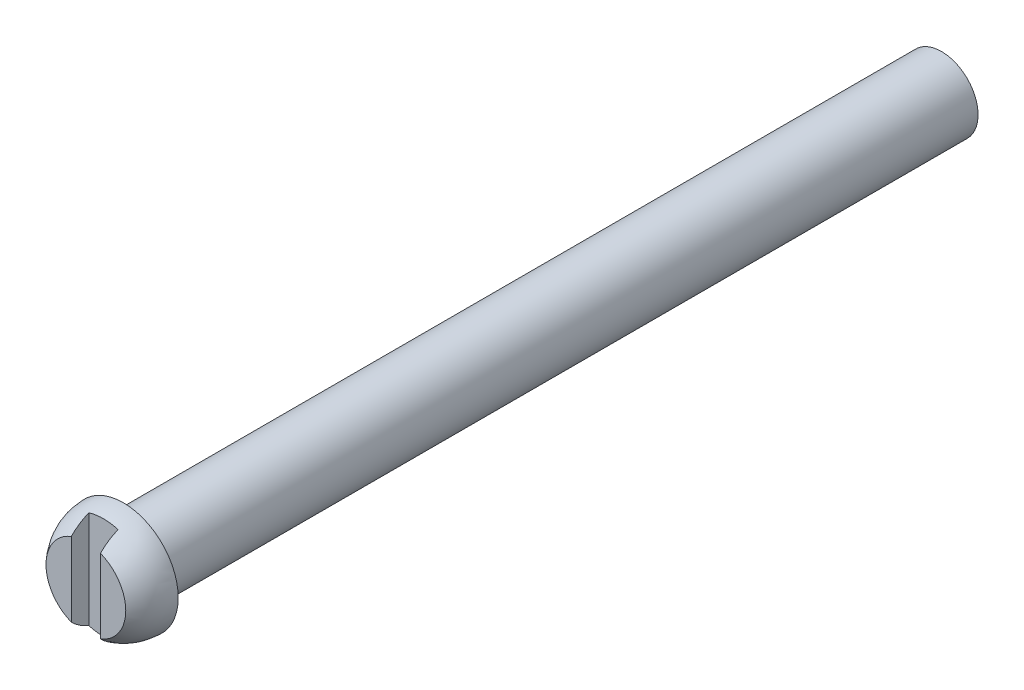
ISO-10303-21;
HEADER;
FILE_DESCRIPTION(('STEP AP214'),'2;1');
FILE_NAME('part.step','',(''),(''),'','','');
FILE_SCHEMA(('AUTOMOTIVE_DESIGN { 1 0 10303 214 1 1 1 1 }'));
ENDSEC;
DATA;
#1=APPLICATION_CONTEXT('core data for automotive mechanical design processes');
#2=APPLICATION_PROTOCOL_DEFINITION('international standard','automotive_design',2000,#1);
#3=PRODUCT_CONTEXT('',#1,'mechanical');
#4=PRODUCT('Part','Part','',(#3));
#5=PRODUCT_RELATED_PRODUCT_CATEGORY('part','',(#4));
#6=PRODUCT_DEFINITION_FORMATION('','',#4);
#7=PRODUCT_DEFINITION_CONTEXT('part definition',#1,'design');
#8=PRODUCT_DEFINITION('design','',#6,#7);
#9=PRODUCT_DEFINITION_SHAPE('','',#8);
#10=(LENGTH_UNIT() NAMED_UNIT(*) SI_UNIT(.MILLI.,.METRE.));
#11=(NAMED_UNIT(*) PLANE_ANGLE_UNIT() SI_UNIT($,.RADIAN.));
#12=(NAMED_UNIT(*) SI_UNIT($,.STERADIAN.) SOLID_ANGLE_UNIT());
#13=UNCERTAINTY_MEASURE_WITH_UNIT(LENGTH_MEASURE(1.E-05),#10,'distance_accuracy_value','');
#14=(GEOMETRIC_REPRESENTATION_CONTEXT(3) GLOBAL_UNCERTAINTY_ASSIGNED_CONTEXT((#13)) GLOBAL_UNIT_ASSIGNED_CONTEXT((#10,
#11,#12)) REPRESENTATION_CONTEXT('',''));
#15=CARTESIAN_POINT('',(0.,0.,0.));
#16=DIRECTION('',(0.,0.,1.));
#17=DIRECTION('',(1.,0.,0.));
#18=AXIS2_PLACEMENT_3D('',#15,#16,#17);
#19=CARTESIAN_POINT('',(10.922,4.84644785326985,23.5854825437784));
#20=DIRECTION('',(0.,0.,1.));
#21=DIRECTION('',(1.,0.,0.));
#22=AXIS2_PLACEMENT_3D('',#19,#20,#21);
#23=PLANE('',#22);
#24=DIRECTION('',(0.,1.,0.));
#25=VECTOR('',#24,1.);
#26=CARTESIAN_POINT('',(1.27,4.84644785326985,23.5854825437784));
#27=LINE('',#26,#25);
#28=CARTESIAN_POINT('',(1.27,-3.22569837496912,23.5854825437784));
#29=VERTEX_POINT('',#28);
#30=CARTESIAN_POINT('',(1.27,3.22569837496912,23.5854825437784));
#31=VERTEX_POINT('',#30);
#32=EDGE_CURVE('E91',#29,#31,#27,.T.);
#33=ORIENTED_EDGE('',*,*,#32,.F.);
#34=CARTESIAN_POINT('',(0.,0.,23.5854825437784));
#35=DIRECTION('',(0.,0.,1.));
#36=DIRECTION('',(1.,0.,0.));
#37=AXIS2_PLACEMENT_3D('',#34,#35,#36);
#38=CIRCLE('',#37,3.46670304558646);
#39=EDGE_CURVE('E106',#29,#31,#38,.T.);
#40=ORIENTED_EDGE('',*,*,#39,.T.);
#41=EDGE_LOOP('',(#33,#40));
#42=FACE_BOUND('',#41,.T.);
#43=ADVANCED_FACE('F41',(#42),#23,.T.);
#44=CARTESIAN_POINT('',(0.,0.,20.32));
#45=DIRECTION('',(0.,1.,0.));
#46=DIRECTION('',(-1.,0.,0.));
#47=AXIS2_PLACEMENT_3D('',#44,#45,#46);
#48=SPHERICAL_SURFACE('',#47,4.7625);
#49=CARTESIAN_POINT('',(0.,0.,22.0614825437784));
#50=DIRECTION('',(0.,0.,-1.));
#51=DIRECTION('',(-1.,0.,0.));
#52=AXIS2_PLACEMENT_3D('',#49,#50,#51);
#53=CIRCLE('',#52,4.43267918980328);
#54=CARTESIAN_POINT('',(-1.27,4.24685116288704,22.0614825437784));
#55=VERTEX_POINT('',#54);
#56=CARTESIAN_POINT('',(1.27,4.24685116288704,22.0614825437784));
#57=VERTEX_POINT('',#56);
#58=EDGE_CURVE('E11',#55,#57,#53,.T.);
#59=ORIENTED_EDGE('',*,*,#58,.T.);
#60=CARTESIAN_POINT('',(1.27,0.,20.32));
#61=DIRECTION('',(1.,0.,0.));
#62=DIRECTION('',(0.,1.,0.));
#63=AXIS2_PLACEMENT_3D('',#60,#61,#62);
#64=CIRCLE('',#63,4.5900442535993);
#65=EDGE_CURVE('E65',#57,#31,#64,.T.);
#66=ORIENTED_EDGE('',*,*,#65,.T.);
#67=ORIENTED_EDGE('',*,*,#39,.F.);
#68=CARTESIAN_POINT('',(1.27,-4.24685116288704,22.0614825437784));
#69=VERTEX_POINT('',#68);
#70=EDGE_CURVE('E101',#29,#69,#64,.T.);
#71=ORIENTED_EDGE('',*,*,#70,.T.);
#72=CARTESIAN_POINT('',(-1.27,-4.24685116288704,22.0614825437784));
#73=VERTEX_POINT('',#72);
#74=EDGE_CURVE('E45',#69,#73,#53,.T.);
#75=ORIENTED_EDGE('',*,*,#74,.T.);
#76=CARTESIAN_POINT('',(-1.27,0.,20.32));
#77=DIRECTION('',(-1.,0.,0.));
#78=DIRECTION('',(0.,-1.,0.));
#79=AXIS2_PLACEMENT_3D('',#76,#77,#78);
#80=CIRCLE('',#79,4.5900442535993);
#81=CARTESIAN_POINT('',(-1.27,-3.22569837496912,23.5854825437784));
#82=VERTEX_POINT('',#81);
#83=EDGE_CURVE('E85',#73,#82,#80,.T.);
#84=ORIENTED_EDGE('',*,*,#83,.T.);
#85=CARTESIAN_POINT('',(-1.27,3.22569837496912,23.5854825437784));
#86=VERTEX_POINT('',#85);
#87=EDGE_CURVE('E98',#86,#82,#38,.T.);
#88=ORIENTED_EDGE('',*,*,#87,.F.);
#89=EDGE_CURVE('E57',#86,#55,#80,.T.);
#90=ORIENTED_EDGE('',*,*,#89,.T.);
#91=EDGE_LOOP('',(#59,#66,#67,#71,#75,#84,#88,#90));
#92=FACE_BOUND('',#91,.T.);
#93=CARTESIAN_POINT('',(0.,0.,20.32));
#94=DIRECTION('',(0.,0.,-1.));
#95=DIRECTION('',(-1.,0.,0.));
#96=AXIS2_PLACEMENT_3D('',#93,#94,#95);
#97=CIRCLE('',#96,4.7625);
#98=CARTESIAN_POINT('',(-4.7625,0.,20.32));
#99=VERTEX_POINT('',#98);
#100=EDGE_CURVE('E105',#99,#99,#97,.T.);
#101=ORIENTED_EDGE('',*,*,#100,.F.);
#102=EDGE_LOOP('',(#101));
#103=FACE_BOUND('',#102,.T.);
#104=ADVANCED_FACE('F96',(#92,#103),#48,.T.);
#105=CARTESIAN_POINT('',(0.,0.,20.32));
#106=DIRECTION('',(0.,0.,-1.));
#107=DIRECTION('',(-1.,0.,0.));
#108=AXIS2_PLACEMENT_3D('',#105,#106,#107);
#109=CYLINDRICAL_SURFACE('',#108,3.175);
#110=CARTESIAN_POINT('',(0.,0.,20.32));
#111=DIRECTION('',(0.,0.,1.));
#112=DIRECTION('',(1.,0.,0.));
#113=AXIS2_PLACEMENT_3D('',#110,#111,#112);
#114=CIRCLE('',#113,3.175);
#115=CARTESIAN_POINT('',(3.175,0.,20.32));
#116=VERTEX_POINT('',#115);
#117=EDGE_CURVE('E92',#116,#116,#114,.T.);
#118=ORIENTED_EDGE('',*,*,#117,.F.);
#119=EDGE_LOOP('',(#118));
#120=FACE_BOUND('',#119,.T.);
#121=CARTESIAN_POINT('',(0.,0.,-50.8));
#122=DIRECTION('',(0.,0.,-1.));
#123=DIRECTION('',(-1.,0.,0.));
#124=AXIS2_PLACEMENT_3D('',#121,#122,#123);
#125=CIRCLE('',#124,3.175);
#126=CARTESIAN_POINT('',(-3.175,0.,-50.8));
#127=VERTEX_POINT('',#126);
#128=EDGE_CURVE('E151',#127,#127,#125,.T.);
#129=ORIENTED_EDGE('',*,*,#128,.F.);
#130=EDGE_LOOP('',(#129));
#131=FACE_BOUND('',#130,.T.);
#132=ADVANCED_FACE('F43',(#120,#131),#109,.T.);
#133=CARTESIAN_POINT('',(0.,0.,20.32));
#134=DIRECTION('',(0.,0.,-1.));
#135=DIRECTION('',(-1.,0.,0.));
#136=AXIS2_PLACEMENT_3D('',#133,#134,#135);
#137=PLANE('',#136);
#138=ORIENTED_EDGE('',*,*,#117,.T.);
#139=EDGE_LOOP('',(#138));
#140=FACE_BOUND('',#139,.T.);
#141=ORIENTED_EDGE('',*,*,#100,.T.);
#142=EDGE_LOOP('',(#141));
#143=FACE_BOUND('',#142,.T.);
#144=ADVANCED_FACE('F131',(#140,#143),#137,.T.);
#145=DIRECTION('',(0.,-1.,0.));
#146=VECTOR('',#145,1.);
#147=CARTESIAN_POINT('',(-1.27,4.84644785326985,23.5854825437784));
#148=LINE('',#147,#146);
#149=EDGE_CURVE('E82',#86,#82,#148,.T.);
#150=ORIENTED_EDGE('',*,*,#149,.F.);
#151=ORIENTED_EDGE('',*,*,#87,.T.);
#152=EDGE_LOOP('',(#150,#151));
#153=FACE_BOUND('',#152,.T.);
#154=ADVANCED_FACE('F103',(#153),#23,.T.);
#155=CARTESIAN_POINT('',(0.,0.,22.0614825437784));
#156=DIRECTION('',(0.,0.,-1.));
#157=DIRECTION('',(-1.,0.,0.));
#158=AXIS2_PLACEMENT_3D('',#155,#156,#157);
#159=PLANE('',#158);
#160=DIRECTION('',(0.,-1.,0.));
#161=VECTOR('',#160,1.);
#162=CARTESIAN_POINT('',(-1.27,5.61311796557698,22.0614825437784));
#163=LINE('',#162,#161);
#164=EDGE_CURVE('E157',#55,#73,#163,.T.);
#165=ORIENTED_EDGE('',*,*,#164,.T.);
#166=ORIENTED_EDGE('',*,*,#74,.F.);
#167=DIRECTION('',(0.,1.,0.));
#168=VECTOR('',#167,1.);
#169=CARTESIAN_POINT('',(1.27,5.61311796557698,22.0614825437784));
#170=LINE('',#169,#168);
#171=EDGE_CURVE('E154',#69,#57,#170,.T.);
#172=ORIENTED_EDGE('',*,*,#171,.T.);
#173=ORIENTED_EDGE('',*,*,#58,.F.);
#174=EDGE_LOOP('',(#165,#166,#172,#173));
#175=FACE_BOUND('',#174,.T.);
#176=ADVANCED_FACE('F130',(#175),#159,.F.);
#177=CARTESIAN_POINT('',(1.27,5.61311796557698,22.0614825437784));
#178=DIRECTION('',(1.,0.,0.));
#179=DIRECTION('',(0.,1.,0.));
#180=AXIS2_PLACEMENT_3D('',#177,#178,#179);
#181=PLANE('',#180);
#182=ORIENTED_EDGE('',*,*,#171,.F.);
#183=ORIENTED_EDGE('',*,*,#70,.F.);
#184=ORIENTED_EDGE('',*,*,#32,.T.);
#185=ORIENTED_EDGE('',*,*,#65,.F.);
#186=EDGE_LOOP('',(#182,#183,#184,#185));
#187=FACE_BOUND('',#186,.T.);
#188=ADVANCED_FACE('F117',(#187),#181,.F.);
#189=CARTESIAN_POINT('',(-1.27,5.61311796557698,22.0614825437784));
#190=DIRECTION('',(-1.,0.,0.));
#191=DIRECTION('',(0.,-1.,0.));
#192=AXIS2_PLACEMENT_3D('',#189,#190,#191);
#193=PLANE('',#192);
#194=ORIENTED_EDGE('',*,*,#164,.F.);
#195=ORIENTED_EDGE('',*,*,#89,.F.);
#196=ORIENTED_EDGE('',*,*,#149,.T.);
#197=ORIENTED_EDGE('',*,*,#83,.F.);
#198=EDGE_LOOP('',(#194,#195,#196,#197));
#199=FACE_BOUND('',#198,.T.);
#200=ADVANCED_FACE('F84',(#199),#193,.F.);
#201=CARTESIAN_POINT('',(0.,0.,-50.8));
#202=DIRECTION('',(0.,0.,-1.));
#203=DIRECTION('',(-1.,0.,0.));
#204=AXIS2_PLACEMENT_3D('',#201,#202,#203);
#205=PLANE('',#204);
#206=ORIENTED_EDGE('',*,*,#128,.T.);
#207=EDGE_LOOP('',(#206));
#208=FACE_BOUND('',#207,.T.);
#209=ADVANCED_FACE('F163',(#208),#205,.T.);
#210=CLOSED_SHELL('',(#43,#104,#132,#144,#154,#176,#188,#200,#209));
#211=MANIFOLD_SOLID_BREP('B2',#210);
#212=ADVANCED_BREP_SHAPE_REPRESENTATION('',(#18,#211),#14);
#213=SHAPE_DEFINITION_REPRESENTATION(#9,#212);
ENDSEC;
END-ISO-10303-21;
